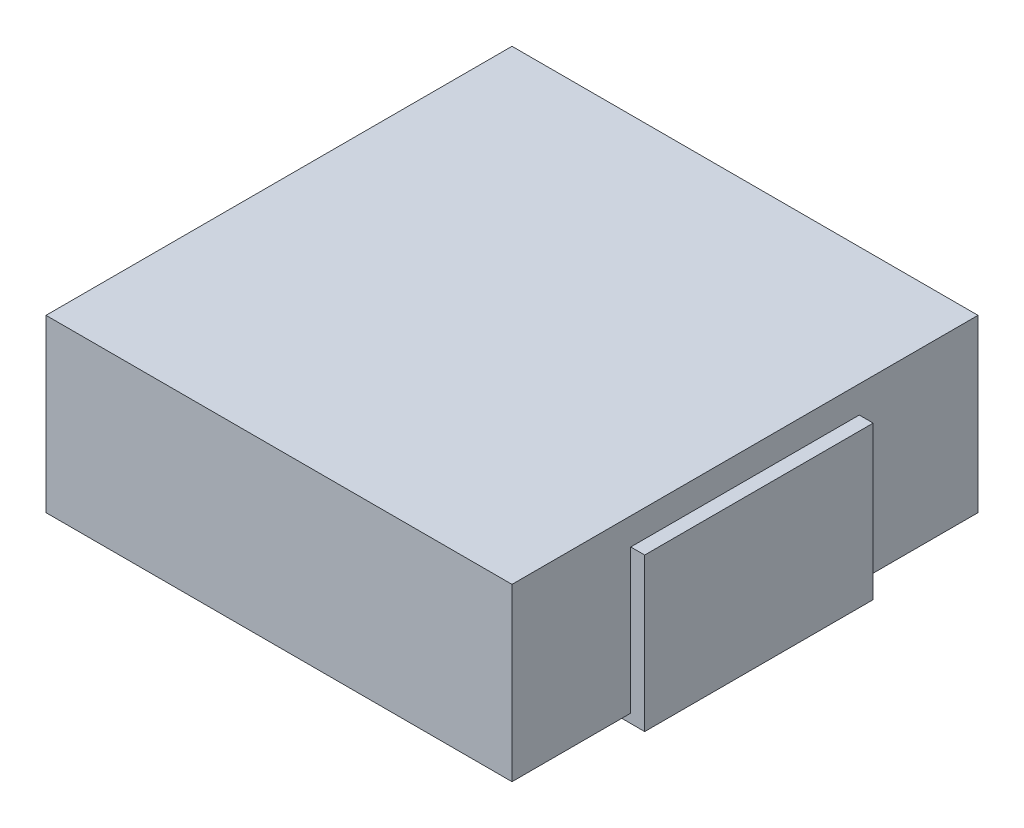
ISO-10303-21;
HEADER;
FILE_DESCRIPTION(('STEP AP214'),'2;1');
FILE_NAME('part.step','',(''),(''),'','','');
FILE_SCHEMA(('AUTOMOTIVE_DESIGN { 1 0 10303 214 1 1 1 1 }'));
ENDSEC;
DATA;
#1=APPLICATION_CONTEXT('core data for automotive mechanical design processes');
#2=APPLICATION_PROTOCOL_DEFINITION('international standard','automotive_design',2000,#1);
#3=PRODUCT_CONTEXT('',#1,'mechanical');
#4=PRODUCT('Part','Part','',(#3));
#5=PRODUCT_RELATED_PRODUCT_CATEGORY('part','',(#4));
#6=PRODUCT_DEFINITION_FORMATION('','',#4);
#7=PRODUCT_DEFINITION_CONTEXT('part definition',#1,'design');
#8=PRODUCT_DEFINITION('design','',#6,#7);
#9=PRODUCT_DEFINITION_SHAPE('','',#8);
#10=(LENGTH_UNIT() NAMED_UNIT(*) SI_UNIT(.MILLI.,.METRE.));
#11=(NAMED_UNIT(*) PLANE_ANGLE_UNIT() SI_UNIT($,.RADIAN.));
#12=(NAMED_UNIT(*) SI_UNIT($,.STERADIAN.) SOLID_ANGLE_UNIT());
#13=UNCERTAINTY_MEASURE_WITH_UNIT(LENGTH_MEASURE(1.E-05),#10,'distance_accuracy_value','');
#14=(GEOMETRIC_REPRESENTATION_CONTEXT(3) GLOBAL_UNCERTAINTY_ASSIGNED_CONTEXT((#13)) GLOBAL_UNIT_ASSIGNED_CONTEXT((#10,
#11,#12)) REPRESENTATION_CONTEXT('',''));
#15=CARTESIAN_POINT('',(0.,0.,0.));
#16=DIRECTION('',(0.,0.,1.));
#17=DIRECTION('',(1.,0.,0.));
#18=AXIS2_PLACEMENT_3D('',#15,#16,#17);
#19=CARTESIAN_POINT('',(2.745,1.7,1.27));
#20=DIRECTION('',(-1.,0.,0.));
#21=DIRECTION('',(0.,0.,1.));
#22=AXIS2_PLACEMENT_3D('',#19,#20,#21);
#23=PLANE('',#22);
#24=DIRECTION('',(0.,0.,-1.));
#25=VECTOR('',#24,1.);
#26=CARTESIAN_POINT('',(2.745,0.,1.27));
#27=LINE('',#26,#25);
#28=CARTESIAN_POINT('',(2.745,0.,1.27));
#29=VERTEX_POINT('',#28);
#30=CARTESIAN_POINT('',(2.745,0.,-1.27));
#31=VERTEX_POINT('',#30);
#32=EDGE_CURVE('E106',#29,#31,#27,.T.);
#33=ORIENTED_EDGE('',*,*,#32,.T.);
#34=DIRECTION('',(0.,-1.,0.));
#35=VECTOR('',#34,1.);
#36=CARTESIAN_POINT('',(2.745,1.7,-1.27));
#37=LINE('',#36,#35);
#38=CARTESIAN_POINT('',(2.745,1.7,-1.27));
#39=VERTEX_POINT('',#38);
#40=EDGE_CURVE('E12',#39,#31,#37,.T.);
#41=ORIENTED_EDGE('',*,*,#40,.F.);
#42=DIRECTION('',(0.,0.,-1.));
#43=VECTOR('',#42,1.);
#44=CARTESIAN_POINT('',(2.745,1.7,1.27));
#45=LINE('',#44,#43);
#46=CARTESIAN_POINT('',(2.745,1.7,1.27));
#47=VERTEX_POINT('',#46);
#48=EDGE_CURVE('E94',#47,#39,#45,.T.);
#49=ORIENTED_EDGE('',*,*,#48,.F.);
#50=DIRECTION('',(0.,-1.,0.));
#51=VECTOR('',#50,1.);
#52=CARTESIAN_POINT('',(2.745,1.7,1.27));
#53=LINE('',#52,#51);
#54=EDGE_CURVE('E102',#47,#29,#53,.T.);
#55=ORIENTED_EDGE('',*,*,#54,.T.);
#56=EDGE_LOOP('',(#33,#41,#49,#55));
#57=FACE_BOUND('',#56,.T.);
#58=ADVANCED_FACE('F43',(#57),#23,.F.);
#59=CARTESIAN_POINT('',(2.745,1.7,-1.27));
#60=DIRECTION('',(0.,0.,1.));
#61=DIRECTION('',(1.,0.,0.));
#62=AXIS2_PLACEMENT_3D('',#59,#60,#61);
#63=PLANE('',#62);
#64=DIRECTION('',(-1.,0.,0.));
#65=VECTOR('',#64,1.);
#66=CARTESIAN_POINT('',(2.745,0.,-1.27));
#67=LINE('',#66,#65);
#68=CARTESIAN_POINT('',(1.725,0.,-1.27));
#69=VERTEX_POINT('',#68);
#70=EDGE_CURVE('E98',#31,#69,#67,.T.);
#71=ORIENTED_EDGE('',*,*,#70,.T.);
#72=DIRECTION('',(0.,-1.,0.));
#73=VECTOR('',#72,1.);
#74=CARTESIAN_POINT('',(1.725,1.7,-1.27));
#75=LINE('',#74,#73);
#76=CARTESIAN_POINT('',(1.725,1.7,-1.27));
#77=VERTEX_POINT('',#76);
#78=EDGE_CURVE('E51',#77,#69,#75,.T.);
#79=ORIENTED_EDGE('',*,*,#78,.F.);
#80=DIRECTION('',(-1.,0.,0.));
#81=VECTOR('',#80,1.);
#82=CARTESIAN_POINT('',(2.745,1.7,-1.27));
#83=LINE('',#82,#81);
#84=EDGE_CURVE('E89',#39,#77,#83,.T.);
#85=ORIENTED_EDGE('',*,*,#84,.F.);
#86=ORIENTED_EDGE('',*,*,#40,.T.);
#87=EDGE_LOOP('',(#71,#79,#85,#86));
#88=FACE_BOUND('',#87,.T.);
#89=ADVANCED_FACE('F97',(#88),#63,.F.);
#90=CARTESIAN_POINT('',(1.725,1.7,1.27));
#91=DIRECTION('',(1.,0.,0.));
#92=DIRECTION('',(0.,0.,-1.));
#93=AXIS2_PLACEMENT_3D('',#90,#91,#92);
#94=PLANE('',#93);
#95=DIRECTION('',(0.,0.,1.));
#96=VECTOR('',#95,1.);
#97=CARTESIAN_POINT('',(1.725,0.,1.27));
#98=LINE('',#97,#96);
#99=CARTESIAN_POINT('',(1.725,0.,1.27));
#100=VERTEX_POINT('',#99);
#101=EDGE_CURVE('E76',#69,#100,#98,.T.);
#102=ORIENTED_EDGE('',*,*,#101,.T.);
#103=DIRECTION('',(0.,-1.,0.));
#104=VECTOR('',#103,1.);
#105=CARTESIAN_POINT('',(1.725,1.7,1.27));
#106=LINE('',#105,#104);
#107=CARTESIAN_POINT('',(1.725,1.7,1.27));
#108=VERTEX_POINT('',#107);
#109=EDGE_CURVE('E99',#108,#100,#106,.T.);
#110=ORIENTED_EDGE('',*,*,#109,.F.);
#111=DIRECTION('',(0.,0.,1.));
#112=VECTOR('',#111,1.);
#113=CARTESIAN_POINT('',(1.725,1.7,1.27));
#114=LINE('',#113,#112);
#115=EDGE_CURVE('E92',#77,#108,#114,.T.);
#116=ORIENTED_EDGE('',*,*,#115,.F.);
#117=ORIENTED_EDGE('',*,*,#78,.T.);
#118=EDGE_LOOP('',(#102,#110,#116,#117));
#119=FACE_BOUND('',#118,.T.);
#120=ADVANCED_FACE('F100',(#119),#94,.F.);
#121=CARTESIAN_POINT('',(2.745,1.7,1.27));
#122=DIRECTION('',(0.,0.,-1.));
#123=DIRECTION('',(-1.,0.,0.));
#124=AXIS2_PLACEMENT_3D('',#121,#122,#123);
#125=PLANE('',#124);
#126=DIRECTION('',(1.,0.,0.));
#127=VECTOR('',#126,1.);
#128=CARTESIAN_POINT('',(2.745,0.,1.27));
#129=LINE('',#128,#127);
#130=EDGE_CURVE('E82',#100,#29,#129,.T.);
#131=ORIENTED_EDGE('',*,*,#130,.T.);
#132=ORIENTED_EDGE('',*,*,#54,.F.);
#133=DIRECTION('',(1.,0.,0.));
#134=VECTOR('',#133,1.);
#135=CARTESIAN_POINT('',(2.745,1.7,1.27));
#136=LINE('',#135,#134);
#137=EDGE_CURVE('E59',#108,#47,#136,.T.);
#138=ORIENTED_EDGE('',*,*,#137,.F.);
#139=ORIENTED_EDGE('',*,*,#109,.T.);
#140=EDGE_LOOP('',(#131,#132,#138,#139));
#141=FACE_BOUND('',#140,.T.);
#142=ADVANCED_FACE('F113',(#141),#125,.F.);
#143=CARTESIAN_POINT('',(2.745,1.7,-1.27));
#144=DIRECTION('',(0.,1.,0.));
#145=DIRECTION('',(0.,0.,1.));
#146=AXIS2_PLACEMENT_3D('',#143,#144,#145);
#147=PLANE('',#146);
#148=ORIENTED_EDGE('',*,*,#48,.T.);
#149=ORIENTED_EDGE('',*,*,#84,.T.);
#150=ORIENTED_EDGE('',*,*,#115,.T.);
#151=ORIENTED_EDGE('',*,*,#137,.T.);
#152=EDGE_LOOP('',(#148,#149,#150,#151));
#153=FACE_BOUND('',#152,.T.);
#154=ADVANCED_FACE('F90',(#153),#147,.T.);
#155=CARTESIAN_POINT('',(2.745,0.,-1.27));
#156=DIRECTION('',(0.,1.,0.));
#157=DIRECTION('',(0.,0.,1.));
#158=AXIS2_PLACEMENT_3D('',#155,#156,#157);
#159=PLANE('',#158);
#160=ORIENTED_EDGE('',*,*,#32,.F.);
#161=ORIENTED_EDGE('',*,*,#130,.F.);
#162=ORIENTED_EDGE('',*,*,#101,.F.);
#163=ORIENTED_EDGE('',*,*,#70,.F.);
#164=EDGE_LOOP('',(#160,#161,#162,#163));
#165=FACE_BOUND('',#164,.T.);
#166=ADVANCED_FACE('F116',(#165),#159,.F.);
#167=CLOSED_SHELL('',(#58,#89,#120,#142,#154,#166));
#168=MANIFOLD_SOLID_BREP('B2',#167);
#169=CARTESIAN_POINT('',(-1.725,1.7,1.27));
#170=DIRECTION('',(-1.,0.,0.));
#171=DIRECTION('',(0.,0.,1.));
#172=AXIS2_PLACEMENT_3D('',#169,#170,#171);
#173=PLANE('',#172);
#174=DIRECTION('',(0.,0.,-1.));
#175=VECTOR('',#174,1.);
#176=CARTESIAN_POINT('',(-1.725,0.,1.27));
#177=LINE('',#176,#175);
#178=CARTESIAN_POINT('',(-1.725,0.,1.27));
#179=VERTEX_POINT('',#178);
#180=CARTESIAN_POINT('',(-1.725,0.,-1.27));
#181=VERTEX_POINT('',#180);
#182=EDGE_CURVE('E238',#179,#181,#177,.T.);
#183=ORIENTED_EDGE('',*,*,#182,.T.);
#184=DIRECTION('',(0.,-1.,0.));
#185=VECTOR('',#184,1.);
#186=CARTESIAN_POINT('',(-1.725,1.7,-1.27));
#187=LINE('',#186,#185);
#188=CARTESIAN_POINT('',(-1.725,1.7,-1.27));
#189=VERTEX_POINT('',#188);
#190=EDGE_CURVE('E41',#189,#181,#187,.T.);
#191=ORIENTED_EDGE('',*,*,#190,.F.);
#192=DIRECTION('',(0.,0.,-1.));
#193=VECTOR('',#192,1.);
#194=CARTESIAN_POINT('',(-1.725,1.7,1.27));
#195=LINE('',#194,#193);
#196=CARTESIAN_POINT('',(-1.725,1.7,1.27));
#197=VERTEX_POINT('',#196);
#198=EDGE_CURVE('E226',#197,#189,#195,.T.);
#199=ORIENTED_EDGE('',*,*,#198,.F.);
#200=DIRECTION('',(0.,-1.,0.));
#201=VECTOR('',#200,1.);
#202=CARTESIAN_POINT('',(-1.725,1.7,1.27));
#203=LINE('',#202,#201);
#204=EDGE_CURVE('E234',#197,#179,#203,.T.);
#205=ORIENTED_EDGE('',*,*,#204,.T.);
#206=EDGE_LOOP('',(#183,#191,#199,#205));
#207=FACE_BOUND('',#206,.T.);
#208=ADVANCED_FACE('F175',(#207),#173,.F.);
#209=CARTESIAN_POINT('',(-2.745,1.7,-1.27));
#210=DIRECTION('',(0.,0.,1.));
#211=DIRECTION('',(1.,0.,0.));
#212=AXIS2_PLACEMENT_3D('',#209,#210,#211);
#213=PLANE('',#212);
#214=DIRECTION('',(-1.,0.,0.));
#215=VECTOR('',#214,1.);
#216=CARTESIAN_POINT('',(-2.745,0.,-1.27));
#217=LINE('',#216,#215);
#218=CARTESIAN_POINT('',(-2.745,0.,-1.27));
#219=VERTEX_POINT('',#218);
#220=EDGE_CURVE('E230',#181,#219,#217,.T.);
#221=ORIENTED_EDGE('',*,*,#220,.T.);
#222=DIRECTION('',(0.,-1.,0.));
#223=VECTOR('',#222,1.);
#224=CARTESIAN_POINT('',(-2.745,1.7,-1.27));
#225=LINE('',#224,#223);
#226=CARTESIAN_POINT('',(-2.745,1.7,-1.27));
#227=VERTEX_POINT('',#226);
#228=EDGE_CURVE('E183',#227,#219,#225,.T.);
#229=ORIENTED_EDGE('',*,*,#228,.F.);
#230=DIRECTION('',(-1.,0.,0.));
#231=VECTOR('',#230,1.);
#232=CARTESIAN_POINT('',(-2.745,1.7,-1.27));
#233=LINE('',#232,#231);
#234=EDGE_CURVE('E221',#189,#227,#233,.T.);
#235=ORIENTED_EDGE('',*,*,#234,.F.);
#236=ORIENTED_EDGE('',*,*,#190,.T.);
#237=EDGE_LOOP('',(#221,#229,#235,#236));
#238=FACE_BOUND('',#237,.T.);
#239=ADVANCED_FACE('F229',(#238),#213,.F.);
#240=CARTESIAN_POINT('',(-2.745,1.7,1.27));
#241=DIRECTION('',(1.,0.,0.));
#242=DIRECTION('',(0.,0.,-1.));
#243=AXIS2_PLACEMENT_3D('',#240,#241,#242);
#244=PLANE('',#243);
#245=DIRECTION('',(0.,0.,1.));
#246=VECTOR('',#245,1.);
#247=CARTESIAN_POINT('',(-2.745,0.,1.27));
#248=LINE('',#247,#246);
#249=CARTESIAN_POINT('',(-2.745,0.,1.27));
#250=VERTEX_POINT('',#249);
#251=EDGE_CURVE('E208',#219,#250,#248,.T.);
#252=ORIENTED_EDGE('',*,*,#251,.T.);
#253=DIRECTION('',(0.,-1.,0.));
#254=VECTOR('',#253,1.);
#255=CARTESIAN_POINT('',(-2.745,1.7,1.27));
#256=LINE('',#255,#254);
#257=CARTESIAN_POINT('',(-2.745,1.7,1.27));
#258=VERTEX_POINT('',#257);
#259=EDGE_CURVE('E231',#258,#250,#256,.T.);
#260=ORIENTED_EDGE('',*,*,#259,.F.);
#261=DIRECTION('',(0.,0.,1.));
#262=VECTOR('',#261,1.);
#263=CARTESIAN_POINT('',(-2.745,1.7,1.27));
#264=LINE('',#263,#262);
#265=EDGE_CURVE('E224',#227,#258,#264,.T.);
#266=ORIENTED_EDGE('',*,*,#265,.F.);
#267=ORIENTED_EDGE('',*,*,#228,.T.);
#268=EDGE_LOOP('',(#252,#260,#266,#267));
#269=FACE_BOUND('',#268,.T.);
#270=ADVANCED_FACE('F232',(#269),#244,.F.);
#271=CARTESIAN_POINT('',(-2.745,1.7,1.27));
#272=DIRECTION('',(0.,0.,-1.));
#273=DIRECTION('',(-1.,0.,0.));
#274=AXIS2_PLACEMENT_3D('',#271,#272,#273);
#275=PLANE('',#274);
#276=DIRECTION('',(1.,0.,0.));
#277=VECTOR('',#276,1.);
#278=CARTESIAN_POINT('',(-2.745,0.,1.27));
#279=LINE('',#278,#277);
#280=EDGE_CURVE('E214',#250,#179,#279,.T.);
#281=ORIENTED_EDGE('',*,*,#280,.T.);
#282=ORIENTED_EDGE('',*,*,#204,.F.);
#283=DIRECTION('',(1.,0.,0.));
#284=VECTOR('',#283,1.);
#285=CARTESIAN_POINT('',(-2.745,1.7,1.27));
#286=LINE('',#285,#284);
#287=EDGE_CURVE('E191',#258,#197,#286,.T.);
#288=ORIENTED_EDGE('',*,*,#287,.F.);
#289=ORIENTED_EDGE('',*,*,#259,.T.);
#290=EDGE_LOOP('',(#281,#282,#288,#289));
#291=FACE_BOUND('',#290,.T.);
#292=ADVANCED_FACE('F245',(#291),#275,.F.);
#293=CARTESIAN_POINT('',(-1.725,1.7,-1.27));
#294=DIRECTION('',(0.,-1.,0.));
#295=DIRECTION('',(0.,0.,-1.));
#296=AXIS2_PLACEMENT_3D('',#293,#294,#295);
#297=PLANE('',#296);
#298=ORIENTED_EDGE('',*,*,#198,.T.);
#299=ORIENTED_EDGE('',*,*,#234,.T.);
#300=ORIENTED_EDGE('',*,*,#265,.T.);
#301=ORIENTED_EDGE('',*,*,#287,.T.);
#302=EDGE_LOOP('',(#298,#299,#300,#301));
#303=FACE_BOUND('',#302,.T.);
#304=ADVANCED_FACE('F222',(#303),#297,.F.);
#305=CARTESIAN_POINT('',(-1.725,0.,-1.27));
#306=DIRECTION('',(0.,-1.,0.));
#307=DIRECTION('',(0.,0.,-1.));
#308=AXIS2_PLACEMENT_3D('',#305,#306,#307);
#309=PLANE('',#308);
#310=ORIENTED_EDGE('',*,*,#182,.F.);
#311=ORIENTED_EDGE('',*,*,#280,.F.);
#312=ORIENTED_EDGE('',*,*,#251,.F.);
#313=ORIENTED_EDGE('',*,*,#220,.F.);
#314=EDGE_LOOP('',(#310,#311,#312,#313));
#315=FACE_BOUND('',#314,.T.);
#316=ADVANCED_FACE('F248',(#315),#309,.T.);
#317=CLOSED_SHELL('',(#208,#239,#270,#292,#304,#316));
#318=MANIFOLD_SOLID_BREP('B6',#317);
#319=CARTESIAN_POINT('',(2.59,2.,2.59));
#320=DIRECTION('',(-1.,0.,0.));
#321=DIRECTION('',(0.,0.,1.));
#322=AXIS2_PLACEMENT_3D('',#319,#320,#321);
#323=PLANE('',#322);
#324=DIRECTION('',(0.,0.,-1.));
#325=VECTOR('',#324,1.);
#326=CARTESIAN_POINT('',(2.59,0.1,2.59));
#327=LINE('',#326,#325);
#328=CARTESIAN_POINT('',(2.59,0.1,2.59));
#329=VERTEX_POINT('',#328);
#330=CARTESIAN_POINT('',(2.59,0.1,-2.59));
#331=VERTEX_POINT('',#330);
#332=EDGE_CURVE('E361',#329,#331,#327,.T.);
#333=ORIENTED_EDGE('',*,*,#332,.T.);
#334=DIRECTION('',(0.,-1.,0.));
#335=VECTOR('',#334,1.);
#336=CARTESIAN_POINT('',(2.59,2.,-2.59));
#337=LINE('',#336,#335);
#338=CARTESIAN_POINT('',(2.59,2.,-2.59));
#339=VERTEX_POINT('',#338);
#340=EDGE_CURVE('E173',#339,#331,#337,.T.);
#341=ORIENTED_EDGE('',*,*,#340,.F.);
#342=DIRECTION('',(0.,0.,-1.));
#343=VECTOR('',#342,1.);
#344=CARTESIAN_POINT('',(2.59,2.,2.59));
#345=LINE('',#344,#343);
#346=CARTESIAN_POINT('',(2.59,2.,2.59));
#347=VERTEX_POINT('',#346);
#348=EDGE_CURVE('E349',#347,#339,#345,.T.);
#349=ORIENTED_EDGE('',*,*,#348,.F.);
#350=DIRECTION('',(0.,-1.,0.));
#351=VECTOR('',#350,1.);
#352=CARTESIAN_POINT('',(2.59,2.,2.59));
#353=LINE('',#352,#351);
#354=EDGE_CURVE('E357',#347,#329,#353,.T.);
#355=ORIENTED_EDGE('',*,*,#354,.T.);
#356=EDGE_LOOP('',(#333,#341,#349,#355));
#357=FACE_BOUND('',#356,.T.);
#358=ADVANCED_FACE('F298',(#357),#323,.F.);
#359=CARTESIAN_POINT('',(-2.59,2.,-2.59));
#360=DIRECTION('',(0.,0.,1.));
#361=DIRECTION('',(1.,0.,0.));
#362=AXIS2_PLACEMENT_3D('',#359,#360,#361);
#363=PLANE('',#362);
#364=DIRECTION('',(-1.,0.,0.));
#365=VECTOR('',#364,1.);
#366=CARTESIAN_POINT('',(-2.59,0.1,-2.59));
#367=LINE('',#366,#365);
#368=CARTESIAN_POINT('',(-2.59,0.1,-2.59));
#369=VERTEX_POINT('',#368);
#370=EDGE_CURVE('E353',#331,#369,#367,.T.);
#371=ORIENTED_EDGE('',*,*,#370,.T.);
#372=DIRECTION('',(0.,-1.,0.));
#373=VECTOR('',#372,1.);
#374=CARTESIAN_POINT('',(-2.59,2.,-2.59));
#375=LINE('',#374,#373);
#376=CARTESIAN_POINT('',(-2.59,2.,-2.59));
#377=VERTEX_POINT('',#376);
#378=EDGE_CURVE('E306',#377,#369,#375,.T.);
#379=ORIENTED_EDGE('',*,*,#378,.F.);
#380=DIRECTION('',(-1.,0.,0.));
#381=VECTOR('',#380,1.);
#382=CARTESIAN_POINT('',(-2.59,2.,-2.59));
#383=LINE('',#382,#381);
#384=EDGE_CURVE('E344',#339,#377,#383,.T.);
#385=ORIENTED_EDGE('',*,*,#384,.F.);
#386=ORIENTED_EDGE('',*,*,#340,.T.);
#387=EDGE_LOOP('',(#371,#379,#385,#386));
#388=FACE_BOUND('',#387,.T.);
#389=ADVANCED_FACE('F352',(#388),#363,.F.);
#390=CARTESIAN_POINT('',(-2.59,2.,2.59));
#391=DIRECTION('',(1.,0.,0.));
#392=DIRECTION('',(0.,0.,-1.));
#393=AXIS2_PLACEMENT_3D('',#390,#391,#392);
#394=PLANE('',#393);
#395=DIRECTION('',(0.,0.,1.));
#396=VECTOR('',#395,1.);
#397=CARTESIAN_POINT('',(-2.59,0.1,2.59));
#398=LINE('',#397,#396);
#399=CARTESIAN_POINT('',(-2.59,0.1,2.59));
#400=VERTEX_POINT('',#399);
#401=EDGE_CURVE('E331',#369,#400,#398,.T.);
#402=ORIENTED_EDGE('',*,*,#401,.T.);
#403=DIRECTION('',(0.,-1.,0.));
#404=VECTOR('',#403,1.);
#405=CARTESIAN_POINT('',(-2.59,2.,2.59));
#406=LINE('',#405,#404);
#407=CARTESIAN_POINT('',(-2.59,2.,2.59));
#408=VERTEX_POINT('',#407);
#409=EDGE_CURVE('E354',#408,#400,#406,.T.);
#410=ORIENTED_EDGE('',*,*,#409,.F.);
#411=DIRECTION('',(0.,0.,1.));
#412=VECTOR('',#411,1.);
#413=CARTESIAN_POINT('',(-2.59,2.,2.59));
#414=LINE('',#413,#412);
#415=EDGE_CURVE('E347',#377,#408,#414,.T.);
#416=ORIENTED_EDGE('',*,*,#415,.F.);
#417=ORIENTED_EDGE('',*,*,#378,.T.);
#418=EDGE_LOOP('',(#402,#410,#416,#417));
#419=FACE_BOUND('',#418,.T.);
#420=ADVANCED_FACE('F355',(#419),#394,.F.);
#421=CARTESIAN_POINT('',(-2.59,2.,2.59));
#422=DIRECTION('',(0.,0.,-1.));
#423=DIRECTION('',(-1.,0.,0.));
#424=AXIS2_PLACEMENT_3D('',#421,#422,#423);
#425=PLANE('',#424);
#426=DIRECTION('',(1.,0.,0.));
#427=VECTOR('',#426,1.);
#428=CARTESIAN_POINT('',(-2.59,0.1,2.59));
#429=LINE('',#428,#427);
#430=EDGE_CURVE('E337',#400,#329,#429,.T.);
#431=ORIENTED_EDGE('',*,*,#430,.T.);
#432=ORIENTED_EDGE('',*,*,#354,.F.);
#433=DIRECTION('',(1.,0.,0.));
#434=VECTOR('',#433,1.);
#435=CARTESIAN_POINT('',(-2.59,2.,2.59));
#436=LINE('',#435,#434);
#437=EDGE_CURVE('E314',#408,#347,#436,.T.);
#438=ORIENTED_EDGE('',*,*,#437,.F.);
#439=ORIENTED_EDGE('',*,*,#409,.T.);
#440=EDGE_LOOP('',(#431,#432,#438,#439));
#441=FACE_BOUND('',#440,.T.);
#442=ADVANCED_FACE('F368',(#441),#425,.F.);
#443=CARTESIAN_POINT('',(2.59,2.,-2.59));
#444=DIRECTION('',(0.,-1.,0.));
#445=DIRECTION('',(0.,0.,-1.));
#446=AXIS2_PLACEMENT_3D('',#443,#444,#445);
#447=PLANE('',#446);
#448=ORIENTED_EDGE('',*,*,#348,.T.);
#449=ORIENTED_EDGE('',*,*,#384,.T.);
#450=ORIENTED_EDGE('',*,*,#415,.T.);
#451=ORIENTED_EDGE('',*,*,#437,.T.);
#452=EDGE_LOOP('',(#448,#449,#450,#451));
#453=FACE_BOUND('',#452,.T.);
#454=ADVANCED_FACE('F345',(#453),#447,.F.);
#455=CARTESIAN_POINT('',(2.59,0.1,-2.59));
#456=DIRECTION('',(0.,-1.,0.));
#457=DIRECTION('',(0.,0.,-1.));
#458=AXIS2_PLACEMENT_3D('',#455,#456,#457);
#459=PLANE('',#458);
#460=ORIENTED_EDGE('',*,*,#332,.F.);
#461=ORIENTED_EDGE('',*,*,#430,.F.);
#462=ORIENTED_EDGE('',*,*,#401,.F.);
#463=ORIENTED_EDGE('',*,*,#370,.F.);
#464=EDGE_LOOP('',(#460,#461,#462,#463));
#465=FACE_BOUND('',#464,.T.);
#466=ADVANCED_FACE('F371',(#465),#459,.T.);
#467=CLOSED_SHELL('',(#358,#389,#420,#442,#454,#466));
#468=MANIFOLD_SOLID_BREP('B35',#467);
#469=ADVANCED_BREP_SHAPE_REPRESENTATION('',(#18,#168,#318,#468),#14);
#470=SHAPE_DEFINITION_REPRESENTATION(#9,#469);
ENDSEC;
END-ISO-10303-21;
